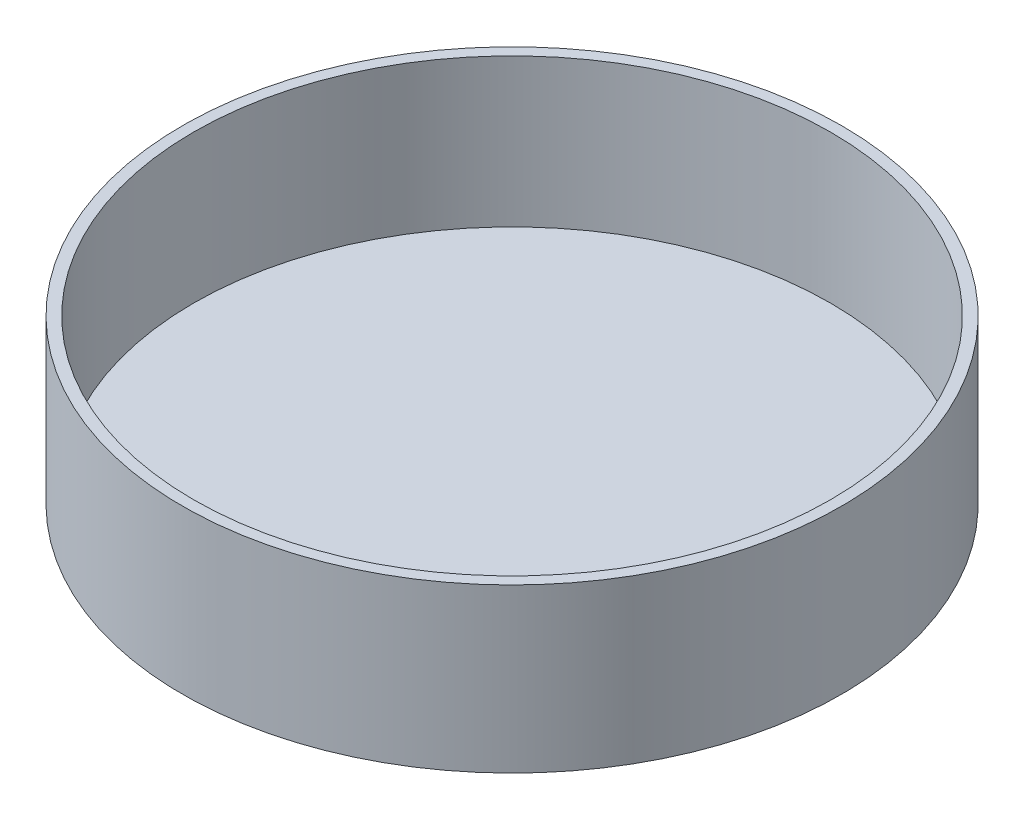
ISO-10303-21;
HEADER;
FILE_DESCRIPTION(('STEP AP214'),'2;1');
FILE_NAME('part.step','',(''),(''),'','','');
FILE_SCHEMA(('AUTOMOTIVE_DESIGN { 1 0 10303 214 1 1 1 1 }'));
ENDSEC;
DATA;
#1=APPLICATION_CONTEXT('core data for automotive mechanical design processes');
#2=APPLICATION_PROTOCOL_DEFINITION('international standard','automotive_design',2000,#1);
#3=PRODUCT_CONTEXT('',#1,'mechanical');
#4=PRODUCT('Part','Part','',(#3));
#5=PRODUCT_RELATED_PRODUCT_CATEGORY('part','',(#4));
#6=PRODUCT_DEFINITION_FORMATION('','',#4);
#7=PRODUCT_DEFINITION_CONTEXT('part definition',#1,'design');
#8=PRODUCT_DEFINITION('design','',#6,#7);
#9=PRODUCT_DEFINITION_SHAPE('','',#8);
#10=(LENGTH_UNIT() NAMED_UNIT(*) SI_UNIT(.MILLI.,.METRE.));
#11=(NAMED_UNIT(*) PLANE_ANGLE_UNIT() SI_UNIT($,.RADIAN.));
#12=(NAMED_UNIT(*) SI_UNIT($,.STERADIAN.) SOLID_ANGLE_UNIT());
#13=UNCERTAINTY_MEASURE_WITH_UNIT(LENGTH_MEASURE(1.E-05),#10,'distance_accuracy_value','');
#14=(GEOMETRIC_REPRESENTATION_CONTEXT(3) GLOBAL_UNCERTAINTY_ASSIGNED_CONTEXT((#13)) GLOBAL_UNIT_ASSIGNED_CONTEXT((#10,
#11,#12)) REPRESENTATION_CONTEXT('',''));
#15=CARTESIAN_POINT('',(0.,0.,0.));
#16=DIRECTION('',(0.,0.,1.));
#17=DIRECTION('',(1.,0.,0.));
#18=AXIS2_PLACEMENT_3D('',#15,#16,#17);
#19=CARTESIAN_POINT('',(0.,0.,0.));
#20=DIRECTION('',(0.,1.,0.));
#21=DIRECTION('',(0.,0.,1.));
#22=AXIS2_PLACEMENT_3D('',#19,#20,#21);
#23=PLANE('',#22);
#24=CARTESIAN_POINT('',(0.,0.,0.));
#25=DIRECTION('',(0.,-1.,0.));
#26=DIRECTION('',(0.,0.,-1.));
#27=AXIS2_PLACEMENT_3D('',#24,#25,#26);
#28=CIRCLE('',#27,141.2875);
#29=CARTESIAN_POINT('',(0.,0.,-141.2875));
#30=VERTEX_POINT('',#29);
#31=EDGE_CURVE('E10',#30,#30,#28,.T.);
#32=ORIENTED_EDGE('',*,*,#31,.T.);
#33=EDGE_LOOP('',(#32));
#34=FACE_BOUND('',#33,.T.);
#35=ADVANCED_FACE('F39',(#34),#23,.F.);
#36=CARTESIAN_POINT('',(0.,-45.633687212475,0.));
#37=DIRECTION('',(0.,-1.,0.));
#38=DIRECTION('',(0.,0.,-1.));
#39=AXIS2_PLACEMENT_3D('',#36,#37,#38);
#40=CYLINDRICAL_SURFACE('',#39,141.2875);
#41=ORIENTED_EDGE('',*,*,#31,.F.);
#42=EDGE_LOOP('',(#41));
#43=FACE_BOUND('',#42,.T.);
#44=CARTESIAN_POINT('',(0.,69.85,0.));
#45=DIRECTION('',(0.,-1.,0.));
#46=DIRECTION('',(0.,0.,-1.));
#47=AXIS2_PLACEMENT_3D('',#44,#45,#46);
#48=CIRCLE('',#47,141.2875);
#49=CARTESIAN_POINT('',(0.,69.85,-141.2875));
#50=VERTEX_POINT('',#49);
#51=EDGE_CURVE('E46',#50,#50,#48,.T.);
#52=ORIENTED_EDGE('',*,*,#51,.T.);
#53=EDGE_LOOP('',(#52));
#54=FACE_BOUND('',#53,.T.);
#55=ADVANCED_FACE('F78',(#43,#54),#40,.T.);
#56=CARTESIAN_POINT('',(0.,69.85,141.2875));
#57=DIRECTION('',(0.,-1.,0.));
#58=DIRECTION('',(0.,0.,-1.));
#59=AXIS2_PLACEMENT_3D('',#56,#57,#58);
#60=PLANE('',#59);
#61=ORIENTED_EDGE('',*,*,#51,.F.);
#62=EDGE_LOOP('',(#61));
#63=FACE_BOUND('',#62,.T.);
#64=CARTESIAN_POINT('',(0.,69.85,0.));
#65=DIRECTION('',(0.,-1.,0.));
#66=DIRECTION('',(0.,0.,-1.));
#67=AXIS2_PLACEMENT_3D('',#64,#65,#66);
#68=CIRCLE('',#67,136.525);
#69=CARTESIAN_POINT('',(0.,69.85,-136.525));
#70=VERTEX_POINT('',#69);
#71=EDGE_CURVE('E52',#70,#70,#68,.T.);
#72=ORIENTED_EDGE('',*,*,#71,.T.);
#73=EDGE_LOOP('',(#72));
#74=FACE_BOUND('',#73,.T.);
#75=ADVANCED_FACE('F74',(#63,#74),#60,.F.);
#76=CARTESIAN_POINT('',(0.,-45.633687212475,0.));
#77=DIRECTION('',(0.,-1.,0.));
#78=DIRECTION('',(0.,0.,-1.));
#79=AXIS2_PLACEMENT_3D('',#76,#77,#78);
#80=CYLINDRICAL_SURFACE('',#79,136.525);
#81=ORIENTED_EDGE('',*,*,#71,.F.);
#82=EDGE_LOOP('',(#81));
#83=FACE_BOUND('',#82,.T.);
#84=CARTESIAN_POINT('',(0.,6.34999999999998,0.));
#85=DIRECTION('',(0.,-1.,0.));
#86=DIRECTION('',(0.,0.,-1.));
#87=AXIS2_PLACEMENT_3D('',#84,#85,#86);
#88=CIRCLE('',#87,136.525);
#89=CARTESIAN_POINT('',(0.,6.34999999999998,-136.525));
#90=VERTEX_POINT('',#89);
#91=EDGE_CURVE('E58',#90,#90,#88,.T.);
#92=ORIENTED_EDGE('',*,*,#91,.T.);
#93=EDGE_LOOP('',(#92));
#94=FACE_BOUND('',#93,.T.);
#95=ADVANCED_FACE('F66',(#83,#94),#80,.F.);
#96=CARTESIAN_POINT('',(0.,6.34999999999998,136.525));
#97=DIRECTION('',(0.,-1.,0.));
#98=DIRECTION('',(0.,0.,-1.));
#99=AXIS2_PLACEMENT_3D('',#96,#97,#98);
#100=PLANE('',#99);
#101=ORIENTED_EDGE('',*,*,#91,.F.);
#102=EDGE_LOOP('',(#101));
#103=FACE_BOUND('',#102,.T.);
#104=ADVANCED_FACE('F68',(#103),#100,.F.);
#105=CLOSED_SHELL('',(#35,#55,#75,#95,#104));
#106=MANIFOLD_SOLID_BREP('B2',#105);
#107=ADVANCED_BREP_SHAPE_REPRESENTATION('',(#18,#106),#14);
#108=SHAPE_DEFINITION_REPRESENTATION(#9,#107);
ENDSEC;
END-ISO-10303-21;
